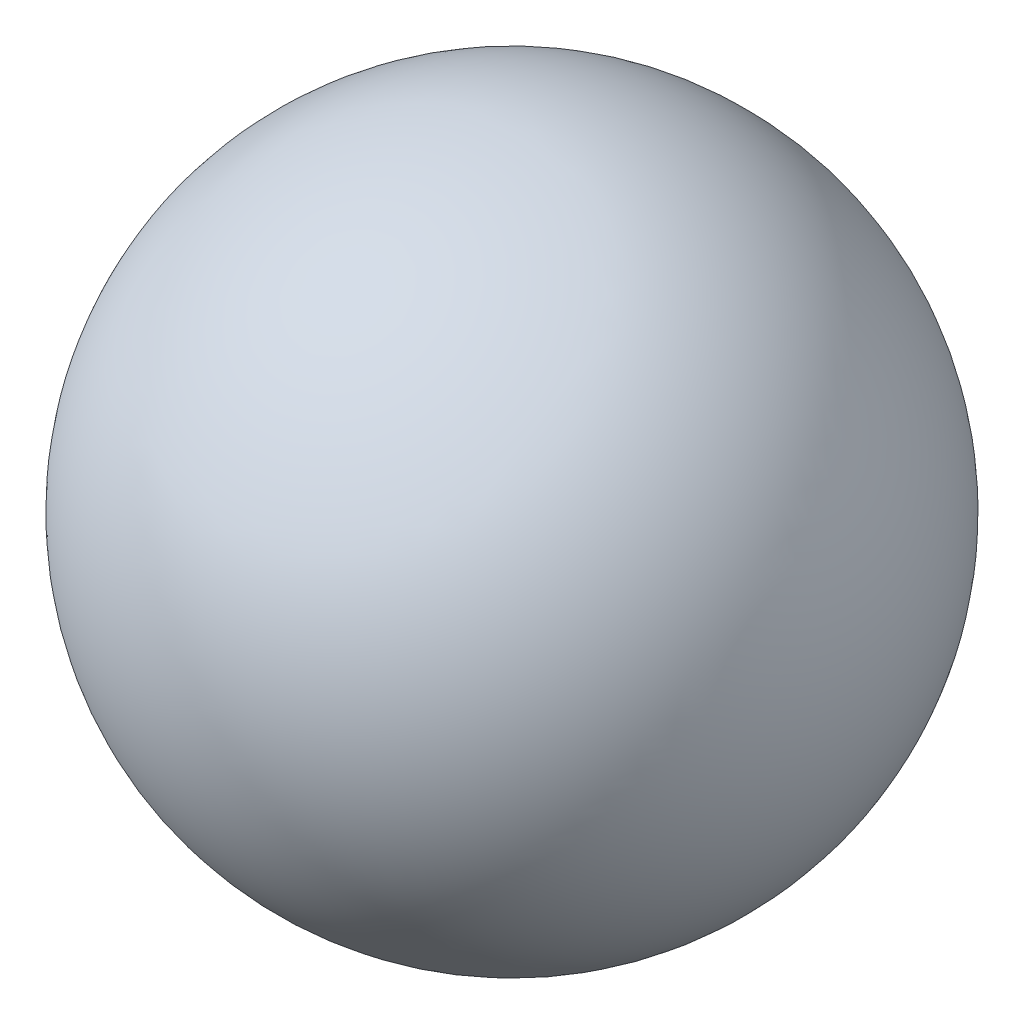
ISO-10303-21;
HEADER;
FILE_DESCRIPTION(('STEP AP214'),'2;1');
FILE_NAME('part.step','',(''),(''),'','','');
FILE_SCHEMA(('AUTOMOTIVE_DESIGN { 1 0 10303 214 1 1 1 1 }'));
ENDSEC;
DATA;
#1=APPLICATION_CONTEXT('core data for automotive mechanical design processes');
#2=APPLICATION_PROTOCOL_DEFINITION('international standard','automotive_design',2000,#1);
#3=PRODUCT_CONTEXT('',#1,'mechanical');
#4=PRODUCT('Part','Part','',(#3));
#5=PRODUCT_RELATED_PRODUCT_CATEGORY('part','',(#4));
#6=PRODUCT_DEFINITION_FORMATION('','',#4);
#7=PRODUCT_DEFINITION_CONTEXT('part definition',#1,'design');
#8=PRODUCT_DEFINITION('design','',#6,#7);
#9=PRODUCT_DEFINITION_SHAPE('','',#8);
#10=(LENGTH_UNIT() NAMED_UNIT(*) SI_UNIT(.MILLI.,.METRE.));
#11=(NAMED_UNIT(*) PLANE_ANGLE_UNIT() SI_UNIT($,.RADIAN.));
#12=(NAMED_UNIT(*) SI_UNIT($,.STERADIAN.) SOLID_ANGLE_UNIT());
#13=UNCERTAINTY_MEASURE_WITH_UNIT(LENGTH_MEASURE(1.E-05),#10,'distance_accuracy_value','');
#14=(GEOMETRIC_REPRESENTATION_CONTEXT(3) GLOBAL_UNCERTAINTY_ASSIGNED_CONTEXT((#13)) GLOBAL_UNIT_ASSIGNED_CONTEXT((#10,
#11,#12)) REPRESENTATION_CONTEXT('',''));
#15=CARTESIAN_POINT('',(0.,0.,0.));
#16=DIRECTION('',(0.,0.,1.));
#17=DIRECTION('',(1.,0.,0.));
#18=AXIS2_PLACEMENT_3D('',#15,#16,#17);
#19=CARTESIAN_POINT('',(0.,0.,0.));
#20=DIRECTION('',(-1.,0.,0.));
#21=DIRECTION('',(0.,1.,0.));
#22=AXIS2_PLACEMENT_3D('',#19,#20,#21);
#23=SPHERICAL_SURFACE('',#22,0.75);
#24=CARTESIAN_POINT('',(-0.75,0.,0.));
#25=VERTEX_POINT('',#24);
#26=VERTEX_LOOP('',#25);
#27=FACE_BOUND('',#26,.T.);
#28=ADVANCED_FACE('F39',(#27),#23,.T.);
#29=CLOSED_SHELL('',(#28));
#30=MANIFOLD_SOLID_BREP('B2',#29);
#31=ADVANCED_BREP_SHAPE_REPRESENTATION('',(#18,#30),#14);
#32=SHAPE_DEFINITION_REPRESENTATION(#9,#31);
ENDSEC;
END-ISO-10303-21;
